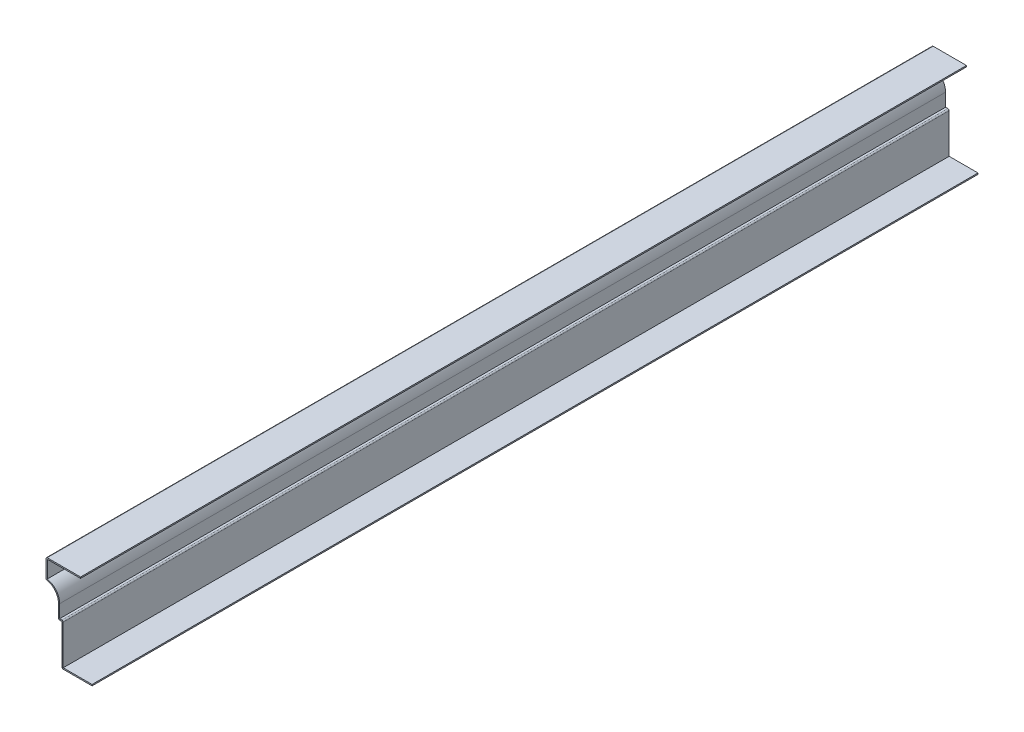
ISO-10303-21;
HEADER;
FILE_DESCRIPTION(('STEP AP214'),'2;1');
FILE_NAME('part.step','',(''),(''),'','','');
FILE_SCHEMA(('AUTOMOTIVE_DESIGN { 1 0 10303 214 1 1 1 1 }'));
ENDSEC;
DATA;
#1=APPLICATION_CONTEXT('core data for automotive mechanical design processes');
#2=APPLICATION_PROTOCOL_DEFINITION('international standard','automotive_design',2000,#1);
#3=PRODUCT_CONTEXT('',#1,'mechanical');
#4=PRODUCT('Part','Part','',(#3));
#5=PRODUCT_RELATED_PRODUCT_CATEGORY('part','',(#4));
#6=PRODUCT_DEFINITION_FORMATION('','',#4);
#7=PRODUCT_DEFINITION_CONTEXT('part definition',#1,'design');
#8=PRODUCT_DEFINITION('design','',#6,#7);
#9=PRODUCT_DEFINITION_SHAPE('','',#8);
#10=(LENGTH_UNIT() NAMED_UNIT(*) SI_UNIT(.MILLI.,.METRE.));
#11=(NAMED_UNIT(*) PLANE_ANGLE_UNIT() SI_UNIT($,.RADIAN.));
#12=(NAMED_UNIT(*) SI_UNIT($,.STERADIAN.) SOLID_ANGLE_UNIT());
#13=UNCERTAINTY_MEASURE_WITH_UNIT(LENGTH_MEASURE(1.E-05),#10,'distance_accuracy_value','');
#14=(GEOMETRIC_REPRESENTATION_CONTEXT(3) GLOBAL_UNCERTAINTY_ASSIGNED_CONTEXT((#13)) GLOBAL_UNIT_ASSIGNED_CONTEXT((#10,
#11,#12)) REPRESENTATION_CONTEXT('',''));
#15=CARTESIAN_POINT('',(0.,0.,0.));
#16=DIRECTION('',(0.,0.,1.));
#17=DIRECTION('',(1.,0.,0.));
#18=AXIS2_PLACEMENT_3D('',#15,#16,#17);
#19=CARTESIAN_POINT('',(-41.275,78.232,-793.75));
#20=DIRECTION('',(0.,-1.,0.));
#21=DIRECTION('',(0.,0.,-1.));
#22=AXIS2_PLACEMENT_3D('',#19,#20,#21);
#23=PLANE('',#22);
#24=DIRECTION('',(1.,0.,0.));
#25=VECTOR('',#24,1.);
#26=CARTESIAN_POINT('',(-41.275,78.232,0.));
#27=LINE('',#26,#25);
#28=CARTESIAN_POINT('',(-40.132,78.232,0.));
#29=VERTEX_POINT('',#28);
#30=CARTESIAN_POINT('',(-10.31875,78.232,0.));
#31=VERTEX_POINT('',#30);
#32=EDGE_CURVE('E242',#29,#31,#27,.T.);
#33=ORIENTED_EDGE('',*,*,#32,.F.);
#34=DIRECTION('',(0.,0.,1.));
#35=VECTOR('',#34,1.);
#36=CARTESIAN_POINT('',(-40.132,78.232,-793.75));
#37=LINE('',#36,#35);
#38=CARTESIAN_POINT('',(-40.132,78.232,-793.75));
#39=VERTEX_POINT('',#38);
#40=EDGE_CURVE('E203',#39,#29,#37,.T.);
#41=ORIENTED_EDGE('',*,*,#40,.F.);
#42=DIRECTION('',(1.,0.,0.));
#43=VECTOR('',#42,1.);
#44=CARTESIAN_POINT('',(-41.275,78.232,-793.75));
#45=LINE('',#44,#43);
#46=CARTESIAN_POINT('',(-10.31875,78.232,-793.75));
#47=VERTEX_POINT('',#46);
#48=EDGE_CURVE('E185',#39,#47,#45,.T.);
#49=ORIENTED_EDGE('',*,*,#48,.T.);
#50=DIRECTION('',(0.,0.,1.));
#51=VECTOR('',#50,1.);
#52=CARTESIAN_POINT('',(-10.31875,78.232,-793.75));
#53=LINE('',#52,#51);
#54=EDGE_CURVE('E193',#47,#31,#53,.T.);
#55=ORIENTED_EDGE('',*,*,#54,.T.);
#56=EDGE_LOOP('',(#33,#41,#49,#55));
#57=FACE_BOUND('',#56,.T.);
#58=ADVANCED_FACE('F35',(#57),#23,.T.);
#59=CARTESIAN_POINT('',(-40.132,61.9125,-793.75));
#60=DIRECTION('',(1.,0.,0.));
#61=DIRECTION('',(0.,1.,0.));
#62=AXIS2_PLACEMENT_3D('',#59,#60,#61);
#63=PLANE('',#62);
#64=DIRECTION('',(0.,1.,0.));
#65=VECTOR('',#64,1.);
#66=CARTESIAN_POINT('',(-40.132,61.9125,0.));
#67=LINE('',#66,#65);
#68=CARTESIAN_POINT('',(-40.132,62.8831454045131,0.));
#69=VERTEX_POINT('',#68);
#70=EDGE_CURVE('E204',#69,#29,#67,.T.);
#71=ORIENTED_EDGE('',*,*,#70,.F.);
#72=DIRECTION('',(0.,0.,1.));
#73=VECTOR('',#72,1.);
#74=CARTESIAN_POINT('',(-40.132,62.8831454045131,-793.75));
#75=LINE('',#74,#73);
#76=CARTESIAN_POINT('',(-40.132,62.8831454045131,-793.75));
#77=VERTEX_POINT('',#76);
#78=EDGE_CURVE('E279',#77,#69,#75,.T.);
#79=ORIENTED_EDGE('',*,*,#78,.F.);
#80=DIRECTION('',(0.,1.,0.));
#81=VECTOR('',#80,1.);
#82=CARTESIAN_POINT('',(-40.132,61.9125,-793.75));
#83=LINE('',#82,#81);
#84=EDGE_CURVE('E201',#77,#39,#83,.T.);
#85=ORIENTED_EDGE('',*,*,#84,.T.);
#86=ORIENTED_EDGE('',*,*,#40,.T.);
#87=EDGE_LOOP('',(#71,#79,#85,#86));
#88=FACE_BOUND('',#87,.T.);
#89=ADVANCED_FACE('F360',(#88),#63,.T.);
#90=CARTESIAN_POINT('',(-42.8625,49.3121093810549,-793.75));
#91=DIRECTION('',(0.,0.,1.));
#92=DIRECTION('',(1.,0.,0.));
#93=AXIS2_PLACEMENT_3D('',#90,#91,#92);
#94=CYLINDRICAL_SURFACE('',#93,13.843);
#95=CARTESIAN_POINT('',(-42.8625,49.3121093810549,0.));
#96=DIRECTION('',(0.,0.,1.));
#97=DIRECTION('',(1.,0.,0.));
#98=AXIS2_PLACEMENT_3D('',#95,#96,#97);
#99=CIRCLE('',#98,13.843);
#100=CARTESIAN_POINT('',(-29.0195,49.3121093810549,0.));
#101=VERTEX_POINT('',#100);
#102=EDGE_CURVE('E207',#101,#69,#99,.T.);
#103=ORIENTED_EDGE('',*,*,#102,.F.);
#104=DIRECTION('',(0.,0.,1.));
#105=VECTOR('',#104,1.);
#106=CARTESIAN_POINT('',(-29.0195,49.3121093810549,-793.75));
#107=LINE('',#106,#105);
#108=CARTESIAN_POINT('',(-29.0195,49.3121093810549,-793.75));
#109=VERTEX_POINT('',#108);
#110=EDGE_CURVE('E281',#109,#101,#107,.T.);
#111=ORIENTED_EDGE('',*,*,#110,.F.);
#112=CARTESIAN_POINT('',(-42.8625,49.3121093810549,-793.75));
#113=DIRECTION('',(0.,0.,1.));
#114=DIRECTION('',(1.,0.,0.));
#115=AXIS2_PLACEMENT_3D('',#112,#113,#114);
#116=CIRCLE('',#115,13.843);
#117=EDGE_CURVE('E238',#109,#77,#116,.T.);
#118=ORIENTED_EDGE('',*,*,#117,.T.);
#119=ORIENTED_EDGE('',*,*,#78,.T.);
#120=EDGE_LOOP('',(#103,#111,#118,#119));
#121=FACE_BOUND('',#120,.T.);
#122=ADVANCED_FACE('F428',(#121),#94,.T.);
#123=CARTESIAN_POINT('',(-29.0195,36.5125,-793.75));
#124=DIRECTION('',(1.,0.,0.));
#125=DIRECTION('',(0.,1.,0.));
#126=AXIS2_PLACEMENT_3D('',#123,#124,#125);
#127=PLANE('',#126);
#128=DIRECTION('',(0.,1.,0.));
#129=VECTOR('',#128,1.);
#130=CARTESIAN_POINT('',(-29.0195,36.5125,0.));
#131=LINE('',#130,#129);
#132=CARTESIAN_POINT('',(-29.0195,37.6555,0.));
#133=VERTEX_POINT('',#132);
#134=EDGE_CURVE('E272',#133,#101,#131,.T.);
#135=ORIENTED_EDGE('',*,*,#134,.F.);
#136=DIRECTION('',(0.,0.,1.));
#137=VECTOR('',#136,1.);
#138=CARTESIAN_POINT('',(-29.0195,37.6555,-793.75));
#139=LINE('',#138,#137);
#140=CARTESIAN_POINT('',(-29.0195,37.6555,-793.75));
#141=VERTEX_POINT('',#140);
#142=EDGE_CURVE('E283',#141,#133,#139,.T.);
#143=ORIENTED_EDGE('',*,*,#142,.F.);
#144=DIRECTION('',(0.,1.,0.));
#145=VECTOR('',#144,1.);
#146=CARTESIAN_POINT('',(-29.0195,36.5125,-793.75));
#147=LINE('',#146,#145);
#148=EDGE_CURVE('E235',#141,#109,#147,.T.);
#149=ORIENTED_EDGE('',*,*,#148,.T.);
#150=ORIENTED_EDGE('',*,*,#110,.T.);
#151=EDGE_LOOP('',(#135,#143,#149,#150));
#152=FACE_BOUND('',#151,.T.);
#153=ADVANCED_FACE('F368',(#152),#127,.T.);
#154=CARTESIAN_POINT('',(-26.9875,37.6555,-793.75));
#155=DIRECTION('',(0.,1.,0.));
#156=DIRECTION('',(0.,0.,1.));
#157=AXIS2_PLACEMENT_3D('',#154,#155,#156);
#158=PLANE('',#157);
#159=DIRECTION('',(1.,0.,0.));
#160=VECTOR('',#159,1.);
#161=CARTESIAN_POINT('',(-26.9875,37.6555,0.));
#162=LINE('',#161,#160);
#163=CARTESIAN_POINT('',(-26.9875,37.6555,0.));
#164=VERTEX_POINT('',#163);
#165=EDGE_CURVE('E270',#164,#133,#162,.F.);
#166=ORIENTED_EDGE('',*,*,#165,.F.);
#167=DIRECTION('',(0.,0.,1.));
#168=VECTOR('',#167,1.);
#169=CARTESIAN_POINT('',(-26.9875,37.6555,-793.75));
#170=LINE('',#169,#168);
#171=CARTESIAN_POINT('',(-26.9875,37.6555,-793.75));
#172=VERTEX_POINT('',#171);
#173=EDGE_CURVE('E326',#164,#172,#170,.F.);
#174=ORIENTED_EDGE('',*,*,#173,.T.);
#175=DIRECTION('',(1.,0.,0.));
#176=VECTOR('',#175,1.);
#177=CARTESIAN_POINT('',(-26.9875,37.6555,-793.75));
#178=LINE('',#177,#176);
#179=EDGE_CURVE('E233',#172,#141,#178,.F.);
#180=ORIENTED_EDGE('',*,*,#179,.T.);
#181=ORIENTED_EDGE('',*,*,#142,.T.);
#182=EDGE_LOOP('',(#166,#174,#180,#181));
#183=FACE_BOUND('',#182,.T.);
#184=ADVANCED_FACE('F371',(#183),#158,.T.);
#185=CARTESIAN_POINT('',(-25.8445,0.,-793.75));
#186=DIRECTION('',(1.,0.,0.));
#187=DIRECTION('',(0.,0.,-1.));
#188=AXIS2_PLACEMENT_3D('',#185,#186,#187);
#189=PLANE('',#188);
#190=DIRECTION('',(0.,1.,0.));
#191=VECTOR('',#190,1.);
#192=CARTESIAN_POINT('',(-25.8445,0.,-793.75));
#193=LINE('',#192,#191);
#194=CARTESIAN_POINT('',(-25.8445,1.143,-793.75));
#195=VERTEX_POINT('',#194);
#196=CARTESIAN_POINT('',(-25.8445,36.5125,-793.75));
#197=VERTEX_POINT('',#196);
#198=EDGE_CURVE('E230',#195,#197,#193,.T.);
#199=ORIENTED_EDGE('',*,*,#198,.T.);
#200=DIRECTION('',(0.,0.,1.));
#201=VECTOR('',#200,1.);
#202=CARTESIAN_POINT('',(-25.8445,36.5125,-793.75));
#203=LINE('',#202,#201);
#204=CARTESIAN_POINT('',(-25.8445,36.5125,0.));
#205=VERTEX_POINT('',#204);
#206=EDGE_CURVE('E323',#197,#205,#203,.T.);
#207=ORIENTED_EDGE('',*,*,#206,.T.);
#208=DIRECTION('',(0.,1.,0.));
#209=VECTOR('',#208,1.);
#210=CARTESIAN_POINT('',(-25.8445,0.,0.));
#211=LINE('',#210,#209);
#212=CARTESIAN_POINT('',(-25.8445,1.143,0.));
#213=VERTEX_POINT('',#212);
#214=EDGE_CURVE('E267',#213,#205,#211,.T.);
#215=ORIENTED_EDGE('',*,*,#214,.F.);
#216=DIRECTION('',(0.,0.,1.));
#217=VECTOR('',#216,1.);
#218=CARTESIAN_POINT('',(-25.8445,1.143,-793.75));
#219=LINE('',#218,#217);
#220=EDGE_CURVE('E286',#195,#213,#219,.T.);
#221=ORIENTED_EDGE('',*,*,#220,.F.);
#222=EDGE_LOOP('',(#199,#207,#215,#221));
#223=FACE_BOUND('',#222,.T.);
#224=ADVANCED_FACE('F380',(#223),#189,.T.);
#225=CARTESIAN_POINT('',(0.,1.143,-793.75));
#226=DIRECTION('',(0.,1.,0.));
#227=DIRECTION('',(-1.,0.,0.));
#228=AXIS2_PLACEMENT_3D('',#225,#226,#227);
#229=PLANE('',#228);
#230=DIRECTION('',(-1.,0.,0.));
#231=VECTOR('',#230,1.);
#232=CARTESIAN_POINT('',(0.,1.143,0.));
#233=LINE('',#232,#231);
#234=CARTESIAN_POINT('',(0.,1.143,0.));
#235=VERTEX_POINT('',#234);
#236=EDGE_CURVE('E264',#235,#213,#233,.T.);
#237=ORIENTED_EDGE('',*,*,#236,.F.);
#238=DIRECTION('',(0.,0.,1.));
#239=VECTOR('',#238,1.);
#240=CARTESIAN_POINT('',(0.,1.143,-793.75));
#241=LINE('',#240,#239);
#242=CARTESIAN_POINT('',(0.,1.143,-793.75));
#243=VERTEX_POINT('',#242);
#244=EDGE_CURVE('E288',#243,#235,#241,.T.);
#245=ORIENTED_EDGE('',*,*,#244,.F.);
#246=DIRECTION('',(-1.,0.,0.));
#247=VECTOR('',#246,1.);
#248=CARTESIAN_POINT('',(0.,1.143,-793.75));
#249=LINE('',#248,#247);
#250=EDGE_CURVE('E227',#243,#195,#249,.T.);
#251=ORIENTED_EDGE('',*,*,#250,.T.);
#252=ORIENTED_EDGE('',*,*,#220,.T.);
#253=EDGE_LOOP('',(#237,#245,#251,#252));
#254=FACE_BOUND('',#253,.T.);
#255=ADVANCED_FACE('F385',(#254),#229,.T.);
#256=CARTESIAN_POINT('',(0.,1.143,-793.75));
#257=DIRECTION('',(-1.,0.,0.));
#258=DIRECTION('',(0.,-1.,0.));
#259=AXIS2_PLACEMENT_3D('',#256,#257,#258);
#260=PLANE('',#259);
#261=DIRECTION('',(0.,-1.,0.));
#262=VECTOR('',#261,1.);
#263=CARTESIAN_POINT('',(0.,1.143,0.));
#264=LINE('',#263,#262);
#265=CARTESIAN_POINT('',(0.,0.,0.));
#266=VERTEX_POINT('',#265);
#267=EDGE_CURVE('E262',#235,#266,#264,.T.);
#268=ORIENTED_EDGE('',*,*,#267,.T.);
#269=DIRECTION('',(0.,0.,1.));
#270=VECTOR('',#269,1.);
#271=CARTESIAN_POINT('',(0.,0.,-793.75));
#272=LINE('',#271,#270);
#273=CARTESIAN_POINT('',(0.,0.,-793.75));
#274=VERTEX_POINT('',#273);
#275=EDGE_CURVE('E290',#274,#266,#272,.T.);
#276=ORIENTED_EDGE('',*,*,#275,.F.);
#277=DIRECTION('',(0.,-1.,0.));
#278=VECTOR('',#277,1.);
#279=CARTESIAN_POINT('',(0.,1.143,-793.75));
#280=LINE('',#279,#278);
#281=EDGE_CURVE('E225',#243,#274,#280,.T.);
#282=ORIENTED_EDGE('',*,*,#281,.F.);
#283=ORIENTED_EDGE('',*,*,#244,.T.);
#284=EDGE_LOOP('',(#268,#276,#282,#283));
#285=FACE_BOUND('',#284,.T.);
#286=ADVANCED_FACE('F392',(#285),#260,.F.);
#287=CARTESIAN_POINT('',(0.,0.,-793.75));
#288=DIRECTION('',(0.,1.,0.));
#289=DIRECTION('',(-1.,0.,0.));
#290=AXIS2_PLACEMENT_3D('',#287,#288,#289);
#291=PLANE('',#290);
#292=DIRECTION('',(-1.,0.,0.));
#293=VECTOR('',#292,1.);
#294=CARTESIAN_POINT('',(0.,0.,0.));
#295=LINE('',#294,#293);
#296=CARTESIAN_POINT('',(-25.8445,0.,0.));
#297=VERTEX_POINT('',#296);
#298=EDGE_CURVE('E259',#266,#297,#295,.T.);
#299=ORIENTED_EDGE('',*,*,#298,.T.);
#300=DIRECTION('',(0.,0.,1.));
#301=VECTOR('',#300,1.);
#302=CARTESIAN_POINT('',(-25.8445,0.,-793.75));
#303=LINE('',#302,#301);
#304=CARTESIAN_POINT('',(-25.8445,0.,-793.75));
#305=VERTEX_POINT('',#304);
#306=EDGE_CURVE('E312',#297,#305,#303,.F.);
#307=ORIENTED_EDGE('',*,*,#306,.T.);
#308=DIRECTION('',(-1.,0.,0.));
#309=VECTOR('',#308,1.);
#310=CARTESIAN_POINT('',(0.,0.,-793.75));
#311=LINE('',#310,#309);
#312=EDGE_CURVE('E223',#274,#305,#311,.T.);
#313=ORIENTED_EDGE('',*,*,#312,.F.);
#314=ORIENTED_EDGE('',*,*,#275,.T.);
#315=EDGE_LOOP('',(#299,#307,#313,#314));
#316=FACE_BOUND('',#315,.T.);
#317=ADVANCED_FACE('F394',(#316),#291,.F.);
#318=CARTESIAN_POINT('',(-26.9875,0.,-793.75));
#319=DIRECTION('',(1.,0.,0.));
#320=DIRECTION('',(0.,0.,-1.));
#321=AXIS2_PLACEMENT_3D('',#318,#319,#320);
#322=PLANE('',#321);
#323=DIRECTION('',(0.,1.,0.));
#324=VECTOR('',#323,1.);
#325=CARTESIAN_POINT('',(-26.9875,0.,-793.75));
#326=LINE('',#325,#324);
#327=CARTESIAN_POINT('',(-26.9875,1.143,-793.75));
#328=VERTEX_POINT('',#327);
#329=CARTESIAN_POINT('',(-26.9875,36.5125,-793.75));
#330=VERTEX_POINT('',#329);
#331=EDGE_CURVE('E221',#328,#330,#326,.T.);
#332=ORIENTED_EDGE('',*,*,#331,.F.);
#333=DIRECTION('',(0.,0.,1.));
#334=VECTOR('',#333,1.);
#335=CARTESIAN_POINT('',(-26.9875,1.143,-793.75));
#336=LINE('',#335,#334);
#337=CARTESIAN_POINT('',(-26.9875,1.143,0.));
#338=VERTEX_POINT('',#337);
#339=EDGE_CURVE('E278',#328,#338,#336,.T.);
#340=ORIENTED_EDGE('',*,*,#339,.T.);
#341=DIRECTION('',(0.,1.,0.));
#342=VECTOR('',#341,1.);
#343=CARTESIAN_POINT('',(-26.9875,0.,0.));
#344=LINE('',#343,#342);
#345=CARTESIAN_POINT('',(-26.9875,36.5125,0.));
#346=VERTEX_POINT('',#345);
#347=EDGE_CURVE('E257',#338,#346,#344,.T.);
#348=ORIENTED_EDGE('',*,*,#347,.T.);
#349=DIRECTION('',(0.,0.,1.));
#350=VECTOR('',#349,1.);
#351=CARTESIAN_POINT('',(-26.9875,36.5125,-793.75));
#352=LINE('',#351,#350);
#353=EDGE_CURVE('E293',#330,#346,#352,.T.);
#354=ORIENTED_EDGE('',*,*,#353,.F.);
#355=EDGE_LOOP('',(#332,#340,#348,#354));
#356=FACE_BOUND('',#355,.T.);
#357=ADVANCED_FACE('F402',(#356),#322,.F.);
#358=CARTESIAN_POINT('',(-26.9875,36.5125,-793.75));
#359=DIRECTION('',(0.,1.,0.));
#360=DIRECTION('',(0.,0.,1.));
#361=AXIS2_PLACEMENT_3D('',#358,#359,#360);
#362=PLANE('',#361);
#363=DIRECTION('',(-1.,0.,0.));
#364=VECTOR('',#363,1.);
#365=CARTESIAN_POINT('',(-26.9875,36.5125,0.));
#366=LINE('',#365,#364);
#367=CARTESIAN_POINT('',(-29.0195,36.5125,0.));
#368=VERTEX_POINT('',#367);
#369=EDGE_CURVE('E254',#346,#368,#366,.T.);
#370=ORIENTED_EDGE('',*,*,#369,.T.);
#371=DIRECTION('',(0.,0.,1.));
#372=VECTOR('',#371,1.);
#373=CARTESIAN_POINT('',(-29.0195,36.5125,-793.75));
#374=LINE('',#373,#372);
#375=CARTESIAN_POINT('',(-29.0195,36.5125,-793.75));
#376=VERTEX_POINT('',#375);
#377=EDGE_CURVE('E331',#368,#376,#374,.F.);
#378=ORIENTED_EDGE('',*,*,#377,.T.);
#379=DIRECTION('',(-1.,0.,0.));
#380=VECTOR('',#379,1.);
#381=CARTESIAN_POINT('',(-26.9875,36.5125,-793.75));
#382=LINE('',#381,#380);
#383=EDGE_CURVE('E218',#330,#376,#382,.T.);
#384=ORIENTED_EDGE('',*,*,#383,.F.);
#385=ORIENTED_EDGE('',*,*,#353,.T.);
#386=EDGE_LOOP('',(#370,#378,#384,#385));
#387=FACE_BOUND('',#386,.T.);
#388=ADVANCED_FACE('F406',(#387),#362,.F.);
#389=CARTESIAN_POINT('',(-30.1625,36.5125,-793.75));
#390=DIRECTION('',(1.,0.,0.));
#391=DIRECTION('',(0.,1.,0.));
#392=AXIS2_PLACEMENT_3D('',#389,#390,#391);
#393=PLANE('',#392);
#394=DIRECTION('',(0.,1.,0.));
#395=VECTOR('',#394,1.);
#396=CARTESIAN_POINT('',(-30.1625,36.5125,-793.75));
#397=LINE('',#396,#395);
#398=CARTESIAN_POINT('',(-30.1625,37.6555,-793.75));
#399=VERTEX_POINT('',#398);
#400=CARTESIAN_POINT('',(-30.1625,49.3121093810549,-793.75));
#401=VERTEX_POINT('',#400);
#402=EDGE_CURVE('E216',#399,#401,#397,.T.);
#403=ORIENTED_EDGE('',*,*,#402,.F.);
#404=DIRECTION('',(0.,0.,1.));
#405=VECTOR('',#404,1.);
#406=CARTESIAN_POINT('',(-30.1625,37.6555,-793.75));
#407=LINE('',#406,#405);
#408=CARTESIAN_POINT('',(-30.1625,37.6555,0.));
#409=VERTEX_POINT('',#408);
#410=EDGE_CURVE('E328',#399,#409,#407,.T.);
#411=ORIENTED_EDGE('',*,*,#410,.T.);
#412=DIRECTION('',(0.,1.,0.));
#413=VECTOR('',#412,1.);
#414=CARTESIAN_POINT('',(-30.1625,36.5125,0.));
#415=LINE('',#414,#413);
#416=CARTESIAN_POINT('',(-30.1625,49.3121093810549,0.));
#417=VERTEX_POINT('',#416);
#418=EDGE_CURVE('E252',#409,#417,#415,.T.);
#419=ORIENTED_EDGE('',*,*,#418,.T.);
#420=DIRECTION('',(0.,0.,1.));
#421=VECTOR('',#420,1.);
#422=CARTESIAN_POINT('',(-30.1625,49.3121093810549,-793.75));
#423=LINE('',#422,#421);
#424=EDGE_CURVE('E296',#401,#417,#423,.T.);
#425=ORIENTED_EDGE('',*,*,#424,.F.);
#426=EDGE_LOOP('',(#403,#411,#419,#425));
#427=FACE_BOUND('',#426,.T.);
#428=ADVANCED_FACE('F414',(#427),#393,.F.);
#429=CARTESIAN_POINT('',(-42.8625,49.3121093810549,-793.75));
#430=DIRECTION('',(0.,0.,1.));
#431=DIRECTION('',(1.,0.,0.));
#432=AXIS2_PLACEMENT_3D('',#429,#430,#431);
#433=CYLINDRICAL_SURFACE('',#432,12.7);
#434=CARTESIAN_POINT('',(-42.8625,49.3121093810549,0.));
#435=DIRECTION('',(0.,0.,1.));
#436=DIRECTION('',(1.,0.,0.));
#437=AXIS2_PLACEMENT_3D('',#434,#435,#436);
#438=CIRCLE('',#437,12.7);
#439=CARTESIAN_POINT('',(-40.3574541284404,61.7626011456954,0.));
#440=VERTEX_POINT('',#439);
#441=EDGE_CURVE('E249',#417,#440,#438,.T.);
#442=ORIENTED_EDGE('',*,*,#441,.T.);
#443=DIRECTION('',(0.,0.,1.));
#444=VECTOR('',#443,1.);
#445=CARTESIAN_POINT('',(-40.3574541284404,61.7626011456954,-793.75));
#446=LINE('',#445,#444);
#447=CARTESIAN_POINT('',(-40.3574541284404,61.7626011456954,-793.75));
#448=VERTEX_POINT('',#447);
#449=EDGE_CURVE('E43',#440,#448,#446,.F.);
#450=ORIENTED_EDGE('',*,*,#449,.T.);
#451=CARTESIAN_POINT('',(-42.8625,49.3121093810549,-793.75));
#452=DIRECTION('',(0.,0.,1.));
#453=DIRECTION('',(1.,0.,0.));
#454=AXIS2_PLACEMENT_3D('',#451,#452,#453);
#455=CIRCLE('',#454,12.7);
#456=EDGE_CURVE('E213',#401,#448,#455,.T.);
#457=ORIENTED_EDGE('',*,*,#456,.F.);
#458=ORIENTED_EDGE('',*,*,#424,.T.);
#459=EDGE_LOOP('',(#442,#450,#457,#458));
#460=FACE_BOUND('',#459,.T.);
#461=ADVANCED_FACE('F339',(#460),#433,.F.);
#462=CARTESIAN_POINT('',(-41.275,61.9125,-793.75));
#463=DIRECTION('',(1.,0.,0.));
#464=DIRECTION('',(0.,1.,0.));
#465=AXIS2_PLACEMENT_3D('',#462,#463,#464);
#466=PLANE('',#465);
#467=DIRECTION('',(0.,1.,0.));
#468=VECTOR('',#467,1.);
#469=CARTESIAN_POINT('',(-41.275,61.9125,-793.75));
#470=LINE('',#469,#468);
#471=CARTESIAN_POINT('',(-41.275,62.8831454045131,-793.75));
#472=VERTEX_POINT('',#471);
#473=CARTESIAN_POINT('',(-41.275,78.232,-793.75));
#474=VERTEX_POINT('',#473);
#475=EDGE_CURVE('E211',#472,#474,#470,.T.);
#476=ORIENTED_EDGE('',*,*,#475,.F.);
#477=DIRECTION('',(0.,0.,1.));
#478=VECTOR('',#477,1.);
#479=CARTESIAN_POINT('',(-41.275,62.8831454045131,-793.75));
#480=LINE('',#479,#478);
#481=CARTESIAN_POINT('',(-41.275,62.8831454045131,0.));
#482=VERTEX_POINT('',#481);
#483=EDGE_CURVE('E334',#472,#482,#480,.T.);
#484=ORIENTED_EDGE('',*,*,#483,.T.);
#485=DIRECTION('',(0.,1.,0.));
#486=VECTOR('',#485,1.);
#487=CARTESIAN_POINT('',(-41.275,61.9125,0.));
#488=LINE('',#487,#486);
#489=CARTESIAN_POINT('',(-41.275,78.232,0.));
#490=VERTEX_POINT('',#489);
#491=EDGE_CURVE('E247',#482,#490,#488,.T.);
#492=ORIENTED_EDGE('',*,*,#491,.T.);
#493=DIRECTION('',(0.,0.,1.));
#494=VECTOR('',#493,1.);
#495=CARTESIAN_POINT('',(-41.275,78.232,-793.75));
#496=LINE('',#495,#494);
#497=EDGE_CURVE('E58',#490,#474,#496,.F.);
#498=ORIENTED_EDGE('',*,*,#497,.T.);
#499=EDGE_LOOP('',(#476,#484,#492,#498));
#500=FACE_BOUND('',#499,.T.);
#501=ADVANCED_FACE('F348',(#500),#466,.F.);
#502=CARTESIAN_POINT('',(-41.275,79.375,-793.75));
#503=DIRECTION('',(0.,-1.,0.));
#504=DIRECTION('',(0.,0.,-1.));
#505=AXIS2_PLACEMENT_3D('',#502,#503,#504);
#506=PLANE('',#505);
#507=DIRECTION('',(1.,0.,0.));
#508=VECTOR('',#507,1.);
#509=CARTESIAN_POINT('',(-41.275,79.375,-793.75));
#510=LINE('',#509,#508);
#511=CARTESIAN_POINT('',(-40.132,79.375,-793.75));
#512=VERTEX_POINT('',#511);
#513=CARTESIAN_POINT('',(-10.31875,79.375,-793.75));
#514=VERTEX_POINT('',#513);
#515=EDGE_CURVE('E187',#512,#514,#510,.T.);
#516=ORIENTED_EDGE('',*,*,#515,.F.);
#517=DIRECTION('',(0.,0.,1.));
#518=VECTOR('',#517,1.);
#519=CARTESIAN_POINT('',(-40.132,79.375,-793.75));
#520=LINE('',#519,#518);
#521=CARTESIAN_POINT('',(-40.132,79.375,0.));
#522=VERTEX_POINT('',#521);
#523=EDGE_CURVE('E11',#512,#522,#520,.T.);
#524=ORIENTED_EDGE('',*,*,#523,.T.);
#525=DIRECTION('',(1.,0.,0.));
#526=VECTOR('',#525,1.);
#527=CARTESIAN_POINT('',(-41.275,79.375,0.));
#528=LINE('',#527,#526);
#529=CARTESIAN_POINT('',(-10.31875,79.375,0.));
#530=VERTEX_POINT('',#529);
#531=EDGE_CURVE('E245',#522,#530,#528,.T.);
#532=ORIENTED_EDGE('',*,*,#531,.T.);
#533=DIRECTION('',(0.,0.,1.));
#534=VECTOR('',#533,1.);
#535=CARTESIAN_POINT('',(-10.31875,79.375,-793.75));
#536=LINE('',#535,#534);
#537=EDGE_CURVE('E200',#514,#530,#536,.T.);
#538=ORIENTED_EDGE('',*,*,#537,.F.);
#539=EDGE_LOOP('',(#516,#524,#532,#538));
#540=FACE_BOUND('',#539,.T.);
#541=ADVANCED_FACE('F356',(#540),#506,.F.);
#542=CARTESIAN_POINT('',(-10.31875,79.375,-793.75));
#543=DIRECTION('',(-1.,0.,0.));
#544=DIRECTION('',(0.,0.,1.));
#545=AXIS2_PLACEMENT_3D('',#542,#543,#544);
#546=PLANE('',#545);
#547=DIRECTION('',(0.,-1.,0.));
#548=VECTOR('',#547,1.);
#549=CARTESIAN_POINT('',(-10.31875,79.375,0.));
#550=LINE('',#549,#548);
#551=EDGE_CURVE('E196',#530,#31,#550,.T.);
#552=ORIENTED_EDGE('',*,*,#551,.T.);
#553=ORIENTED_EDGE('',*,*,#54,.F.);
#554=DIRECTION('',(0.,-1.,0.));
#555=VECTOR('',#554,1.);
#556=CARTESIAN_POINT('',(-10.31875,79.375,-793.75));
#557=LINE('',#556,#555);
#558=EDGE_CURVE('E179',#514,#47,#557,.T.);
#559=ORIENTED_EDGE('',*,*,#558,.F.);
#560=ORIENTED_EDGE('',*,*,#537,.T.);
#561=EDGE_LOOP('',(#552,#553,#559,#560));
#562=FACE_BOUND('',#561,.T.);
#563=ADVANCED_FACE('F194',(#562),#546,.F.);
#564=CARTESIAN_POINT('',(-42.8625,49.3121093810549,-793.75));
#565=DIRECTION('',(0.,0.,1.));
#566=DIRECTION('',(1.,0.,0.));
#567=AXIS2_PLACEMENT_3D('',#564,#565,#566);
#568=PLANE('',#567);
#569=ORIENTED_EDGE('',*,*,#312,.T.);
#570=CARTESIAN_POINT('',(-25.8445,1.143,-793.75));
#571=DIRECTION('',(0.,0.,1.));
#572=DIRECTION('',(1.,0.,0.));
#573=AXIS2_PLACEMENT_3D('',#570,#571,#572);
#574=CIRCLE('',#573,1.143);
#575=EDGE_CURVE('E321',#305,#328,#574,.F.);
#576=ORIENTED_EDGE('',*,*,#575,.T.);
#577=ORIENTED_EDGE('',*,*,#331,.T.);
#578=ORIENTED_EDGE('',*,*,#383,.T.);
#579=CARTESIAN_POINT('',(-29.0195,37.6555,-793.75));
#580=DIRECTION('',(0.,0.,1.));
#581=DIRECTION('',(1.,0.,0.));
#582=AXIS2_PLACEMENT_3D('',#579,#580,#581);
#583=CIRCLE('',#582,1.143);
#584=EDGE_CURVE('E317',#376,#399,#583,.F.);
#585=ORIENTED_EDGE('',*,*,#584,.T.);
#586=ORIENTED_EDGE('',*,*,#402,.T.);
#587=ORIENTED_EDGE('',*,*,#456,.T.);
#588=CARTESIAN_POINT('',(-40.132,62.8831454045131,-793.75));
#589=DIRECTION('',(0.,0.,1.));
#590=DIRECTION('',(1.,0.,0.));
#591=AXIS2_PLACEMENT_3D('',#588,#589,#590);
#592=CIRCLE('',#591,1.143);
#593=EDGE_CURVE('E315',#448,#472,#592,.F.);
#594=ORIENTED_EDGE('',*,*,#593,.T.);
#595=ORIENTED_EDGE('',*,*,#475,.T.);
#596=CARTESIAN_POINT('',(-40.132,78.232,-793.75));
#597=DIRECTION('',(0.,0.,1.));
#598=DIRECTION('',(1.,0.,0.));
#599=AXIS2_PLACEMENT_3D('',#596,#597,#598);
#600=CIRCLE('',#599,1.143);
#601=EDGE_CURVE('E50',#474,#512,#600,.F.);
#602=ORIENTED_EDGE('',*,*,#601,.T.);
#603=ORIENTED_EDGE('',*,*,#515,.T.);
#604=ORIENTED_EDGE('',*,*,#558,.T.);
#605=ORIENTED_EDGE('',*,*,#48,.F.);
#606=ORIENTED_EDGE('',*,*,#84,.F.);
#607=ORIENTED_EDGE('',*,*,#117,.F.);
#608=ORIENTED_EDGE('',*,*,#148,.F.);
#609=ORIENTED_EDGE('',*,*,#179,.F.);
#610=CARTESIAN_POINT('',(-26.9875,36.5125,-793.75));
#611=DIRECTION('',(0.,0.,1.));
#612=DIRECTION('',(1.,0.,0.));
#613=AXIS2_PLACEMENT_3D('',#610,#611,#612);
#614=CIRCLE('',#613,1.143);
#615=EDGE_CURVE('E319',#172,#197,#614,.F.);
#616=ORIENTED_EDGE('',*,*,#615,.T.);
#617=ORIENTED_EDGE('',*,*,#198,.F.);
#618=ORIENTED_EDGE('',*,*,#250,.F.);
#619=ORIENTED_EDGE('',*,*,#281,.T.);
#620=EDGE_LOOP('',(#569,#576,#577,#578,#585,#586,#587,#594,#595,#602,#603,#604,#605,#606,#607,
#608,#609,#616,#617,#618,#619));
#621=FACE_BOUND('',#620,.T.);
#622=ADVANCED_FACE('F182',(#621),#568,.F.);
#623=CARTESIAN_POINT('',(-42.8625,49.3121093810549,0.));
#624=DIRECTION('',(0.,0.,1.));
#625=DIRECTION('',(1.,0.,0.));
#626=AXIS2_PLACEMENT_3D('',#623,#624,#625);
#627=PLANE('',#626);
#628=ORIENTED_EDGE('',*,*,#347,.F.);
#629=CARTESIAN_POINT('',(-25.8445,1.143,0.));
#630=DIRECTION('',(0.,0.,1.));
#631=DIRECTION('',(1.,0.,0.));
#632=AXIS2_PLACEMENT_3D('',#629,#630,#631);
#633=CIRCLE('',#632,1.143);
#634=EDGE_CURVE('E310',#338,#297,#633,.T.);
#635=ORIENTED_EDGE('',*,*,#634,.T.);
#636=ORIENTED_EDGE('',*,*,#298,.F.);
#637=ORIENTED_EDGE('',*,*,#267,.F.);
#638=ORIENTED_EDGE('',*,*,#236,.T.);
#639=ORIENTED_EDGE('',*,*,#214,.T.);
#640=CARTESIAN_POINT('',(-26.9875,36.5125,0.));
#641=DIRECTION('',(0.,0.,1.));
#642=DIRECTION('',(1.,0.,0.));
#643=AXIS2_PLACEMENT_3D('',#640,#641,#642);
#644=CIRCLE('',#643,1.143);
#645=EDGE_CURVE('E308',#205,#164,#644,.T.);
#646=ORIENTED_EDGE('',*,*,#645,.T.);
#647=ORIENTED_EDGE('',*,*,#165,.T.);
#648=ORIENTED_EDGE('',*,*,#134,.T.);
#649=ORIENTED_EDGE('',*,*,#102,.T.);
#650=ORIENTED_EDGE('',*,*,#70,.T.);
#651=ORIENTED_EDGE('',*,*,#32,.T.);
#652=ORIENTED_EDGE('',*,*,#551,.F.);
#653=ORIENTED_EDGE('',*,*,#531,.F.);
#654=CARTESIAN_POINT('',(-40.132,78.232,0.));
#655=DIRECTION('',(0.,0.,1.));
#656=DIRECTION('',(1.,0.,0.));
#657=AXIS2_PLACEMENT_3D('',#654,#655,#656);
#658=CIRCLE('',#657,1.143);
#659=EDGE_CURVE('E302',#522,#490,#658,.T.);
#660=ORIENTED_EDGE('',*,*,#659,.T.);
#661=ORIENTED_EDGE('',*,*,#491,.F.);
#662=CARTESIAN_POINT('',(-40.132,62.8831454045131,0.));
#663=DIRECTION('',(0.,0.,1.));
#664=DIRECTION('',(1.,0.,0.));
#665=AXIS2_PLACEMENT_3D('',#662,#663,#664);
#666=CIRCLE('',#665,1.143);
#667=EDGE_CURVE('E304',#482,#440,#666,.T.);
#668=ORIENTED_EDGE('',*,*,#667,.T.);
#669=ORIENTED_EDGE('',*,*,#441,.F.);
#670=ORIENTED_EDGE('',*,*,#418,.F.);
#671=CARTESIAN_POINT('',(-29.0195,37.6555,0.));
#672=DIRECTION('',(0.,0.,1.));
#673=DIRECTION('',(1.,0.,0.));
#674=AXIS2_PLACEMENT_3D('',#671,#672,#673);
#675=CIRCLE('',#674,1.143);
#676=EDGE_CURVE('E306',#409,#368,#675,.T.);
#677=ORIENTED_EDGE('',*,*,#676,.T.);
#678=ORIENTED_EDGE('',*,*,#369,.F.);
#679=EDGE_LOOP('',(#628,#635,#636,#637,#638,#639,#646,#647,#648,#649,#650,#651,#652,#653,#660,
#661,#668,#669,#670,#677,#678));
#680=FACE_BOUND('',#679,.T.);
#681=ADVANCED_FACE('F351',(#680),#627,.T.);
#682=CARTESIAN_POINT('',(-25.8445,1.143,-793.75));
#683=DIRECTION('',(0.,0.,1.));
#684=DIRECTION('',(1.,0.,0.));
#685=AXIS2_PLACEMENT_3D('',#682,#683,#684);
#686=CYLINDRICAL_SURFACE('',#685,1.143);
#687=ORIENTED_EDGE('',*,*,#575,.F.);
#688=ORIENTED_EDGE('',*,*,#306,.F.);
#689=ORIENTED_EDGE('',*,*,#634,.F.);
#690=ORIENTED_EDGE('',*,*,#339,.F.);
#691=EDGE_LOOP('',(#687,#688,#689,#690));
#692=FACE_BOUND('',#691,.T.);
#693=ADVANCED_FACE('F397',(#692),#686,.T.);
#694=CARTESIAN_POINT('',(-26.9875,36.5125,-793.75));
#695=DIRECTION('',(0.,0.,1.));
#696=DIRECTION('',(1.,0.,0.));
#697=AXIS2_PLACEMENT_3D('',#694,#695,#696);
#698=CYLINDRICAL_SURFACE('',#697,1.143);
#699=ORIENTED_EDGE('',*,*,#615,.F.);
#700=ORIENTED_EDGE('',*,*,#173,.F.);
#701=ORIENTED_EDGE('',*,*,#645,.F.);
#702=ORIENTED_EDGE('',*,*,#206,.F.);
#703=EDGE_LOOP('',(#699,#700,#701,#702));
#704=FACE_BOUND('',#703,.T.);
#705=ADVANCED_FACE('F377',(#704),#698,.T.);
#706=CARTESIAN_POINT('',(-29.0195,37.6555,-793.75));
#707=DIRECTION('',(0.,0.,1.));
#708=DIRECTION('',(1.,0.,0.));
#709=AXIS2_PLACEMENT_3D('',#706,#707,#708);
#710=CYLINDRICAL_SURFACE('',#709,1.143);
#711=ORIENTED_EDGE('',*,*,#584,.F.);
#712=ORIENTED_EDGE('',*,*,#377,.F.);
#713=ORIENTED_EDGE('',*,*,#676,.F.);
#714=ORIENTED_EDGE('',*,*,#410,.F.);
#715=EDGE_LOOP('',(#711,#712,#713,#714));
#716=FACE_BOUND('',#715,.T.);
#717=ADVANCED_FACE('F411',(#716),#710,.T.);
#718=CARTESIAN_POINT('',(-40.132,62.8831454045131,-793.75));
#719=DIRECTION('',(0.,0.,1.));
#720=DIRECTION('',(1.,0.,0.));
#721=AXIS2_PLACEMENT_3D('',#718,#719,#720);
#722=CYLINDRICAL_SURFACE('',#721,1.143);
#723=ORIENTED_EDGE('',*,*,#593,.F.);
#724=ORIENTED_EDGE('',*,*,#449,.F.);
#725=ORIENTED_EDGE('',*,*,#667,.F.);
#726=ORIENTED_EDGE('',*,*,#483,.F.);
#727=EDGE_LOOP('',(#723,#724,#725,#726));
#728=FACE_BOUND('',#727,.T.);
#729=ADVANCED_FACE('F346',(#728),#722,.T.);
#730=CARTESIAN_POINT('',(-40.132,78.232,-793.75));
#731=DIRECTION('',(0.,0.,1.));
#732=DIRECTION('',(1.,0.,0.));
#733=AXIS2_PLACEMENT_3D('',#730,#731,#732);
#734=CYLINDRICAL_SURFACE('',#733,1.143);
#735=ORIENTED_EDGE('',*,*,#601,.F.);
#736=ORIENTED_EDGE('',*,*,#497,.F.);
#737=ORIENTED_EDGE('',*,*,#659,.F.);
#738=ORIENTED_EDGE('',*,*,#523,.F.);
#739=EDGE_LOOP('',(#735,#736,#737,#738));
#740=FACE_BOUND('',#739,.T.);
#741=ADVANCED_FACE('F37',(#740),#734,.T.);
#742=CLOSED_SHELL('',(#58,#89,#122,#153,#184,#224,#255,#286,#317,#357,#388,#428,#461,#501,#541,
#563,#622,#681,#693,#705,#717,#729,#741));
#743=MANIFOLD_SOLID_BREP('B2',#742);
#744=ADVANCED_BREP_SHAPE_REPRESENTATION('',(#18,#743),#14);
#745=SHAPE_DEFINITION_REPRESENTATION(#9,#744);
ENDSEC;
END-ISO-10303-21;
